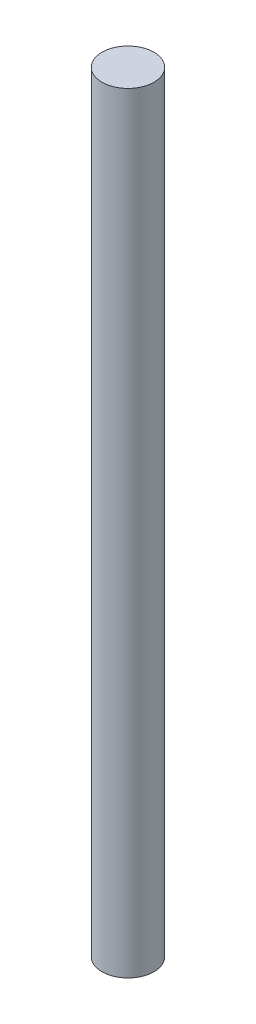
ISO-10303-21;
HEADER;
FILE_DESCRIPTION(('STEP AP214'),'2;1');
FILE_NAME('part.step','',(''),(''),'','','');
FILE_SCHEMA(('AUTOMOTIVE_DESIGN { 1 0 10303 214 1 1 1 1 }'));
ENDSEC;
DATA;
#1=APPLICATION_CONTEXT('core data for automotive mechanical design processes');
#2=APPLICATION_PROTOCOL_DEFINITION('international standard','automotive_design',2000,#1);
#3=PRODUCT_CONTEXT('',#1,'mechanical');
#4=PRODUCT('Part','Part','',(#3));
#5=PRODUCT_RELATED_PRODUCT_CATEGORY('part','',(#4));
#6=PRODUCT_DEFINITION_FORMATION('','',#4);
#7=PRODUCT_DEFINITION_CONTEXT('part definition',#1,'design');
#8=PRODUCT_DEFINITION('design','',#6,#7);
#9=PRODUCT_DEFINITION_SHAPE('','',#8);
#10=(LENGTH_UNIT() NAMED_UNIT(*) SI_UNIT(.MILLI.,.METRE.));
#11=(NAMED_UNIT(*) PLANE_ANGLE_UNIT() SI_UNIT($,.RADIAN.));
#12=(NAMED_UNIT(*) SI_UNIT($,.STERADIAN.) SOLID_ANGLE_UNIT());
#13=UNCERTAINTY_MEASURE_WITH_UNIT(LENGTH_MEASURE(1.E-05),#10,'distance_accuracy_value','');
#14=(GEOMETRIC_REPRESENTATION_CONTEXT(3) GLOBAL_UNCERTAINTY_ASSIGNED_CONTEXT((#13)) GLOBAL_UNIT_ASSIGNED_CONTEXT((#10,
#11,#12)) REPRESENTATION_CONTEXT('',''));
#15=CARTESIAN_POINT('',(0.,0.,0.));
#16=DIRECTION('',(0.,0.,1.));
#17=DIRECTION('',(1.,0.,0.));
#18=AXIS2_PLACEMENT_3D('',#15,#16,#17);
#19=CARTESIAN_POINT('',(0.,44.45,0.));
#20=DIRECTION('',(0.,-1.,0.));
#21=DIRECTION('',(0.,0.,-1.));
#22=AXIS2_PLACEMENT_3D('',#19,#20,#21);
#23=CYLINDRICAL_SURFACE('',#22,1.5);
#24=CARTESIAN_POINT('',(0.,44.45,0.));
#25=DIRECTION('',(0.,1.,0.));
#26=DIRECTION('',(0.,0.,1.));
#27=AXIS2_PLACEMENT_3D('',#24,#25,#26);
#28=CIRCLE('',#27,1.5);
#29=CARTESIAN_POINT('',(0.,44.45,1.5));
#30=VERTEX_POINT('',#29);
#31=EDGE_CURVE('E10',#30,#30,#28,.T.);
#32=ORIENTED_EDGE('',*,*,#31,.F.);
#33=EDGE_LOOP('',(#32));
#34=FACE_BOUND('',#33,.T.);
#35=CARTESIAN_POINT('',(0.,0.,0.));
#36=DIRECTION('',(0.,1.,0.));
#37=DIRECTION('',(0.,0.,1.));
#38=AXIS2_PLACEMENT_3D('',#35,#36,#37);
#39=CIRCLE('',#38,1.5);
#40=CARTESIAN_POINT('',(0.,0.,1.5));
#41=VERTEX_POINT('',#40);
#42=EDGE_CURVE('E40',#41,#41,#39,.T.);
#43=ORIENTED_EDGE('',*,*,#42,.T.);
#44=EDGE_LOOP('',(#43));
#45=FACE_BOUND('',#44,.T.);
#46=ADVANCED_FACE('F37',(#34,#45),#23,.T.);
#47=CARTESIAN_POINT('',(0.,44.45,0.));
#48=DIRECTION('',(0.,1.,0.));
#49=DIRECTION('',(0.,0.,1.));
#50=AXIS2_PLACEMENT_3D('',#47,#48,#49);
#51=PLANE('',#50);
#52=ORIENTED_EDGE('',*,*,#31,.T.);
#53=EDGE_LOOP('',(#52));
#54=FACE_BOUND('',#53,.T.);
#55=ADVANCED_FACE('F54',(#54),#51,.T.);
#56=CARTESIAN_POINT('',(0.,0.,0.));
#57=DIRECTION('',(0.,1.,0.));
#58=DIRECTION('',(0.,0.,1.));
#59=AXIS2_PLACEMENT_3D('',#56,#57,#58);
#60=PLANE('',#59);
#61=ORIENTED_EDGE('',*,*,#42,.F.);
#62=EDGE_LOOP('',(#61));
#63=FACE_BOUND('',#62,.T.);
#64=ADVANCED_FACE('F52',(#63),#60,.F.);
#65=CLOSED_SHELL('',(#46,#55,#64));
#66=MANIFOLD_SOLID_BREP('B2',#65);
#67=ADVANCED_BREP_SHAPE_REPRESENTATION('',(#18,#66),#14);
#68=SHAPE_DEFINITION_REPRESENTATION(#9,#67);
ENDSEC;
END-ISO-10303-21;
